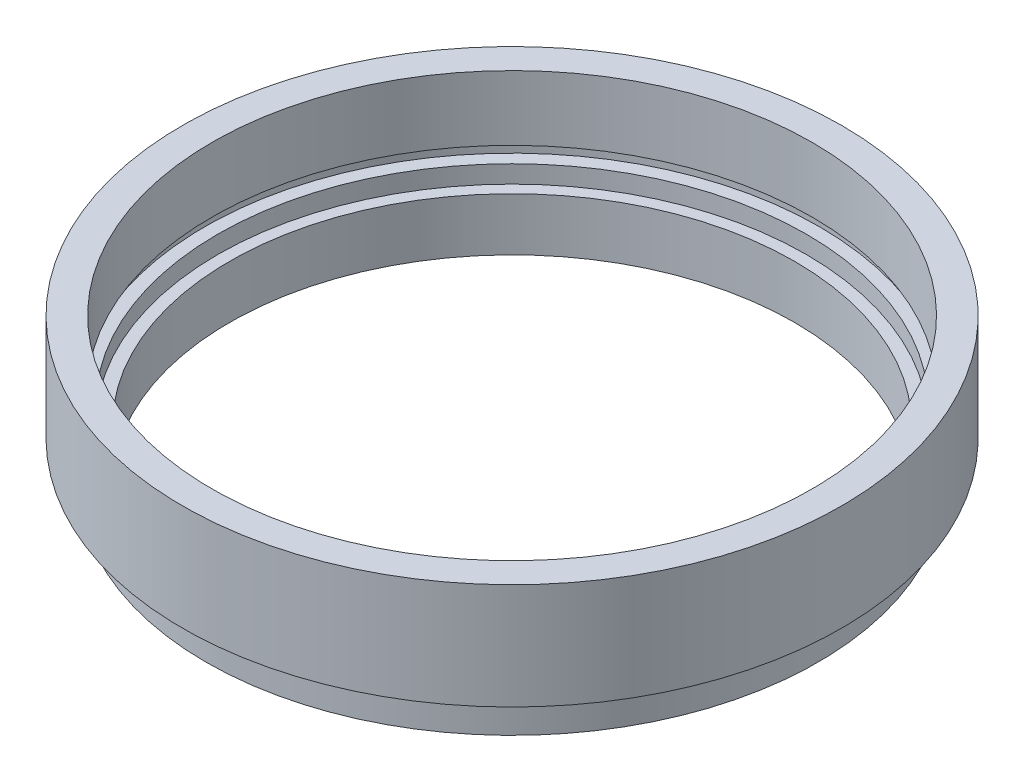
ISO-10303-21;
HEADER;
FILE_DESCRIPTION(('STEP AP214'),'2;1');
FILE_NAME('part.step','',(''),(''),'','','');
FILE_SCHEMA(('AUTOMOTIVE_DESIGN { 1 0 10303 214 1 1 1 1 }'));
ENDSEC;
DATA;
#1=APPLICATION_CONTEXT('core data for automotive mechanical design processes');
#2=APPLICATION_PROTOCOL_DEFINITION('international standard','automotive_design',2000,#1);
#3=PRODUCT_CONTEXT('',#1,'mechanical');
#4=PRODUCT('Part','Part','',(#3));
#5=PRODUCT_RELATED_PRODUCT_CATEGORY('part','',(#4));
#6=PRODUCT_DEFINITION_FORMATION('','',#4);
#7=PRODUCT_DEFINITION_CONTEXT('part definition',#1,'design');
#8=PRODUCT_DEFINITION('design','',#6,#7);
#9=PRODUCT_DEFINITION_SHAPE('','',#8);
#10=(LENGTH_UNIT() NAMED_UNIT(*) SI_UNIT(.MILLI.,.METRE.));
#11=(NAMED_UNIT(*) PLANE_ANGLE_UNIT() SI_UNIT($,.RADIAN.));
#12=(NAMED_UNIT(*) SI_UNIT($,.STERADIAN.) SOLID_ANGLE_UNIT());
#13=UNCERTAINTY_MEASURE_WITH_UNIT(LENGTH_MEASURE(1.E-05),#10,'distance_accuracy_value','');
#14=(GEOMETRIC_REPRESENTATION_CONTEXT(3) GLOBAL_UNCERTAINTY_ASSIGNED_CONTEXT((#13)) GLOBAL_UNIT_ASSIGNED_CONTEXT((#10,
#11,#12)) REPRESENTATION_CONTEXT('',''));
#15=CARTESIAN_POINT('',(0.,0.,0.));
#16=DIRECTION('',(0.,0.,1.));
#17=DIRECTION('',(1.,0.,0.));
#18=AXIS2_PLACEMENT_3D('',#15,#16,#17);
#19=CARTESIAN_POINT('',(0.,0.,0.));
#20=DIRECTION('',(0.,-1.,0.));
#21=DIRECTION('',(0.,0.,-1.));
#22=AXIS2_PLACEMENT_3D('',#19,#20,#21);
#23=CYLINDRICAL_SURFACE('',#22,24.);
#24=CARTESIAN_POINT('',(0.,0.,0.));
#25=DIRECTION('',(0.,-1.,0.));
#26=DIRECTION('',(0.,0.,-1.));
#27=AXIS2_PLACEMENT_3D('',#24,#25,#26);
#28=CIRCLE('',#27,24.);
#29=CARTESIAN_POINT('',(0.,0.,-24.));
#30=VERTEX_POINT('',#29);
#31=EDGE_CURVE('E10',#30,#30,#28,.T.);
#32=ORIENTED_EDGE('',*,*,#31,.T.);
#33=EDGE_LOOP('',(#32));
#34=FACE_BOUND('',#33,.T.);
#35=CARTESIAN_POINT('',(0.,4.5,0.));
#36=DIRECTION('',(0.,-1.,0.));
#37=DIRECTION('',(0.,0.,-1.));
#38=AXIS2_PLACEMENT_3D('',#35,#36,#37);
#39=CIRCLE('',#38,24.);
#40=CARTESIAN_POINT('',(0.,4.5,-24.));
#41=VERTEX_POINT('',#40);
#42=EDGE_CURVE('E79',#41,#41,#39,.T.);
#43=ORIENTED_EDGE('',*,*,#42,.F.);
#44=EDGE_LOOP('',(#43));
#45=FACE_BOUND('',#44,.T.);
#46=ADVANCED_FACE('F33',(#34,#45),#23,.F.);
#47=CARTESIAN_POINT('',(24.,0.,0.));
#48=DIRECTION('',(0.,-1.,0.));
#49=DIRECTION('',(0.,0.,-1.));
#50=AXIS2_PLACEMENT_3D('',#47,#48,#49);
#51=PLANE('',#50);
#52=CARTESIAN_POINT('',(0.,0.,0.));
#53=DIRECTION('',(0.,-1.,0.));
#54=DIRECTION('',(0.,0.,-1.));
#55=AXIS2_PLACEMENT_3D('',#52,#53,#54);
#56=CIRCLE('',#55,26.);
#57=CARTESIAN_POINT('',(0.,0.,-26.));
#58=VERTEX_POINT('',#57);
#59=EDGE_CURVE('E39',#58,#58,#56,.T.);
#60=ORIENTED_EDGE('',*,*,#59,.T.);
#61=EDGE_LOOP('',(#60));
#62=FACE_BOUND('',#61,.T.);
#63=ORIENTED_EDGE('',*,*,#31,.F.);
#64=EDGE_LOOP('',(#63));
#65=FACE_BOUND('',#64,.T.);
#66=ADVANCED_FACE('F87',(#62,#65),#51,.T.);
#67=CARTESIAN_POINT('',(0.,0.,0.));
#68=DIRECTION('',(0.,-1.,0.));
#69=DIRECTION('',(0.,0.,-1.));
#70=AXIS2_PLACEMENT_3D('',#67,#68,#69);
#71=CYLINDRICAL_SURFACE('',#70,26.);
#72=CARTESIAN_POINT('',(0.,2.5,0.));
#73=DIRECTION('',(0.,-1.,0.));
#74=DIRECTION('',(0.,0.,-1.));
#75=AXIS2_PLACEMENT_3D('',#72,#73,#74);
#76=CIRCLE('',#75,26.);
#77=CARTESIAN_POINT('',(0.,2.5,-26.));
#78=VERTEX_POINT('',#77);
#79=EDGE_CURVE('E43',#78,#78,#76,.T.);
#80=ORIENTED_EDGE('',*,*,#79,.T.);
#81=EDGE_LOOP('',(#80));
#82=FACE_BOUND('',#81,.T.);
#83=ORIENTED_EDGE('',*,*,#59,.F.);
#84=EDGE_LOOP('',(#83));
#85=FACE_BOUND('',#84,.T.);
#86=ADVANCED_FACE('F91',(#82,#85),#71,.T.);
#87=CARTESIAN_POINT('',(26.,2.5,0.));
#88=DIRECTION('',(0.,1.,0.));
#89=DIRECTION('',(0.,0.,1.));
#90=AXIS2_PLACEMENT_3D('',#87,#88,#89);
#91=PLANE('',#90);
#92=CARTESIAN_POINT('',(0.,2.5,0.));
#93=DIRECTION('',(0.,-1.,0.));
#94=DIRECTION('',(0.,0.,-1.));
#95=AXIS2_PLACEMENT_3D('',#92,#93,#94);
#96=CIRCLE('',#95,25.5);
#97=CARTESIAN_POINT('',(0.,2.5,-25.5));
#98=VERTEX_POINT('',#97);
#99=EDGE_CURVE('E47',#98,#98,#96,.T.);
#100=ORIENTED_EDGE('',*,*,#99,.T.);
#101=EDGE_LOOP('',(#100));
#102=FACE_BOUND('',#101,.T.);
#103=ORIENTED_EDGE('',*,*,#79,.F.);
#104=EDGE_LOOP('',(#103));
#105=FACE_BOUND('',#104,.T.);
#106=ADVANCED_FACE('F95',(#102,#105),#91,.T.);
#107=CARTESIAN_POINT('',(0.,0.,0.));
#108=DIRECTION('',(0.,-1.,0.));
#109=DIRECTION('',(0.,0.,-1.));
#110=AXIS2_PLACEMENT_3D('',#107,#108,#109);
#111=CYLINDRICAL_SURFACE('',#110,25.5);
#112=CARTESIAN_POINT('',(0.,3.5,0.));
#113=DIRECTION('',(0.,-1.,0.));
#114=DIRECTION('',(0.,0.,-1.));
#115=AXIS2_PLACEMENT_3D('',#112,#113,#114);
#116=CIRCLE('',#115,25.5);
#117=CARTESIAN_POINT('',(0.,3.5,-25.5));
#118=VERTEX_POINT('',#117);
#119=EDGE_CURVE('E52',#118,#118,#116,.T.);
#120=ORIENTED_EDGE('',*,*,#119,.T.);
#121=EDGE_LOOP('',(#120));
#122=FACE_BOUND('',#121,.T.);
#123=ORIENTED_EDGE('',*,*,#99,.F.);
#124=EDGE_LOOP('',(#123));
#125=FACE_BOUND('',#124,.T.);
#126=ADVANCED_FACE('F102',(#122,#125),#111,.T.);
#127=CARTESIAN_POINT('',(25.5,3.5,0.));
#128=DIRECTION('',(0.,-1.,0.));
#129=DIRECTION('',(0.,0.,-1.));
#130=AXIS2_PLACEMENT_3D('',#127,#128,#129);
#131=PLANE('',#130);
#132=CARTESIAN_POINT('',(0.,3.5,0.));
#133=DIRECTION('',(0.,-1.,0.));
#134=DIRECTION('',(0.,0.,-1.));
#135=AXIS2_PLACEMENT_3D('',#132,#133,#134);
#136=CIRCLE('',#135,28.);
#137=CARTESIAN_POINT('',(0.,3.5,-28.));
#138=VERTEX_POINT('',#137);
#139=EDGE_CURVE('E55',#138,#138,#136,.T.);
#140=ORIENTED_EDGE('',*,*,#139,.T.);
#141=EDGE_LOOP('',(#140));
#142=FACE_BOUND('',#141,.T.);
#143=ORIENTED_EDGE('',*,*,#119,.F.);
#144=EDGE_LOOP('',(#143));
#145=FACE_BOUND('',#144,.T.);
#146=ADVANCED_FACE('F106',(#142,#145),#131,.T.);
#147=CARTESIAN_POINT('',(0.,0.,0.));
#148=DIRECTION('',(0.,-1.,0.));
#149=DIRECTION('',(0.,0.,-1.));
#150=AXIS2_PLACEMENT_3D('',#147,#148,#149);
#151=CYLINDRICAL_SURFACE('',#150,28.);
#152=CARTESIAN_POINT('',(0.,12.5,0.));
#153=DIRECTION('',(0.,-1.,0.));
#154=DIRECTION('',(0.,0.,-1.));
#155=AXIS2_PLACEMENT_3D('',#152,#153,#154);
#156=CIRCLE('',#155,28.);
#157=CARTESIAN_POINT('',(0.,12.5,-28.));
#158=VERTEX_POINT('',#157);
#159=EDGE_CURVE('E58',#158,#158,#156,.T.);
#160=ORIENTED_EDGE('',*,*,#159,.T.);
#161=EDGE_LOOP('',(#160));
#162=FACE_BOUND('',#161,.T.);
#163=ORIENTED_EDGE('',*,*,#139,.F.);
#164=EDGE_LOOP('',(#163));
#165=FACE_BOUND('',#164,.T.);
#166=ADVANCED_FACE('F110',(#162,#165),#151,.T.);
#167=CARTESIAN_POINT('',(28.,12.5,0.));
#168=DIRECTION('',(0.,1.,0.));
#169=DIRECTION('',(0.,0.,1.));
#170=AXIS2_PLACEMENT_3D('',#167,#168,#169);
#171=PLANE('',#170);
#172=CARTESIAN_POINT('',(0.,12.5,0.));
#173=DIRECTION('',(0.,-1.,0.));
#174=DIRECTION('',(0.,0.,-1.));
#175=AXIS2_PLACEMENT_3D('',#172,#173,#174);
#176=CIRCLE('',#175,25.5);
#177=CARTESIAN_POINT('',(0.,12.5,-25.5));
#178=VERTEX_POINT('',#177);
#179=EDGE_CURVE('E61',#178,#178,#176,.T.);
#180=ORIENTED_EDGE('',*,*,#179,.T.);
#181=EDGE_LOOP('',(#180));
#182=FACE_BOUND('',#181,.T.);
#183=ORIENTED_EDGE('',*,*,#159,.F.);
#184=EDGE_LOOP('',(#183));
#185=FACE_BOUND('',#184,.T.);
#186=ADVANCED_FACE('F114',(#182,#185),#171,.T.);
#187=CARTESIAN_POINT('',(0.,0.,0.));
#188=DIRECTION('',(0.,-1.,0.));
#189=DIRECTION('',(0.,0.,-1.));
#190=AXIS2_PLACEMENT_3D('',#187,#188,#189);
#191=CYLINDRICAL_SURFACE('',#190,25.5);
#192=CARTESIAN_POINT('',(0.,7.,0.));
#193=DIRECTION('',(0.,-1.,0.));
#194=DIRECTION('',(0.,0.,-1.));
#195=AXIS2_PLACEMENT_3D('',#192,#193,#194);
#196=CIRCLE('',#195,25.5);
#197=CARTESIAN_POINT('',(0.,7.,-25.5));
#198=VERTEX_POINT('',#197);
#199=EDGE_CURVE('E64',#198,#198,#196,.T.);
#200=ORIENTED_EDGE('',*,*,#199,.T.);
#201=EDGE_LOOP('',(#200));
#202=FACE_BOUND('',#201,.T.);
#203=ORIENTED_EDGE('',*,*,#179,.F.);
#204=EDGE_LOOP('',(#203));
#205=FACE_BOUND('',#204,.T.);
#206=ADVANCED_FACE('F118',(#202,#205),#191,.F.);
#207=CARTESIAN_POINT('',(25.5,7.,0.));
#208=DIRECTION('',(0.,-1.,0.));
#209=DIRECTION('',(0.,0.,-1.));
#210=AXIS2_PLACEMENT_3D('',#207,#208,#209);
#211=PLANE('',#210);
#212=CARTESIAN_POINT('',(0.,7.,0.));
#213=DIRECTION('',(0.,-1.,0.));
#214=DIRECTION('',(0.,0.,-1.));
#215=AXIS2_PLACEMENT_3D('',#212,#213,#214);
#216=CIRCLE('',#215,26.1);
#217=CARTESIAN_POINT('',(0.,7.,-26.1));
#218=VERTEX_POINT('',#217);
#219=EDGE_CURVE('E67',#218,#218,#216,.T.);
#220=ORIENTED_EDGE('',*,*,#219,.T.);
#221=EDGE_LOOP('',(#220));
#222=FACE_BOUND('',#221,.T.);
#223=ORIENTED_EDGE('',*,*,#199,.F.);
#224=EDGE_LOOP('',(#223));
#225=FACE_BOUND('',#224,.T.);
#226=ADVANCED_FACE('F122',(#222,#225),#211,.T.);
#227=CARTESIAN_POINT('',(0.,0.,0.));
#228=DIRECTION('',(0.,-1.,0.));
#229=DIRECTION('',(0.,0.,-1.));
#230=AXIS2_PLACEMENT_3D('',#227,#228,#229);
#231=CYLINDRICAL_SURFACE('',#230,26.1);
#232=CARTESIAN_POINT('',(0.,6.,0.));
#233=DIRECTION('',(0.,-1.,0.));
#234=DIRECTION('',(0.,0.,-1.));
#235=AXIS2_PLACEMENT_3D('',#232,#233,#234);
#236=CIRCLE('',#235,26.1);
#237=CARTESIAN_POINT('',(0.,6.,-26.1));
#238=VERTEX_POINT('',#237);
#239=EDGE_CURVE('E70',#238,#238,#236,.T.);
#240=ORIENTED_EDGE('',*,*,#239,.T.);
#241=EDGE_LOOP('',(#240));
#242=FACE_BOUND('',#241,.T.);
#243=ORIENTED_EDGE('',*,*,#219,.F.);
#244=EDGE_LOOP('',(#243));
#245=FACE_BOUND('',#244,.T.);
#246=ADVANCED_FACE('F126',(#242,#245),#231,.F.);
#247=CARTESIAN_POINT('',(26.1,6.,0.));
#248=DIRECTION('',(0.,1.,0.));
#249=DIRECTION('',(0.,0.,1.));
#250=AXIS2_PLACEMENT_3D('',#247,#248,#249);
#251=PLANE('',#250);
#252=CARTESIAN_POINT('',(0.,6.,0.));
#253=DIRECTION('',(0.,-1.,0.));
#254=DIRECTION('',(0.,0.,-1.));
#255=AXIS2_PLACEMENT_3D('',#252,#253,#254);
#256=CIRCLE('',#255,25.);
#257=CARTESIAN_POINT('',(0.,6.,-25.));
#258=VERTEX_POINT('',#257);
#259=EDGE_CURVE('E73',#258,#258,#256,.T.);
#260=ORIENTED_EDGE('',*,*,#259,.T.);
#261=EDGE_LOOP('',(#260));
#262=FACE_BOUND('',#261,.T.);
#263=ORIENTED_EDGE('',*,*,#239,.F.);
#264=EDGE_LOOP('',(#263));
#265=FACE_BOUND('',#264,.T.);
#266=ADVANCED_FACE('F130',(#262,#265),#251,.T.);
#267=CARTESIAN_POINT('',(0.,0.,0.));
#268=DIRECTION('',(0.,-1.,0.));
#269=DIRECTION('',(0.,0.,-1.));
#270=AXIS2_PLACEMENT_3D('',#267,#268,#269);
#271=CYLINDRICAL_SURFACE('',#270,25.);
#272=CARTESIAN_POINT('',(0.,4.5,0.));
#273=DIRECTION('',(0.,-1.,0.));
#274=DIRECTION('',(0.,0.,-1.));
#275=AXIS2_PLACEMENT_3D('',#272,#273,#274);
#276=CIRCLE('',#275,25.);
#277=CARTESIAN_POINT('',(0.,4.5,-25.));
#278=VERTEX_POINT('',#277);
#279=EDGE_CURVE('E76',#278,#278,#276,.T.);
#280=ORIENTED_EDGE('',*,*,#279,.T.);
#281=EDGE_LOOP('',(#280));
#282=FACE_BOUND('',#281,.T.);
#283=ORIENTED_EDGE('',*,*,#259,.F.);
#284=EDGE_LOOP('',(#283));
#285=FACE_BOUND('',#284,.T.);
#286=ADVANCED_FACE('F134',(#282,#285),#271,.F.);
#287=CARTESIAN_POINT('',(25.,4.5,0.));
#288=DIRECTION('',(0.,1.,0.));
#289=DIRECTION('',(0.,0.,1.));
#290=AXIS2_PLACEMENT_3D('',#287,#288,#289);
#291=PLANE('',#290);
#292=ORIENTED_EDGE('',*,*,#42,.T.);
#293=EDGE_LOOP('',(#292));
#294=FACE_BOUND('',#293,.T.);
#295=ORIENTED_EDGE('',*,*,#279,.F.);
#296=EDGE_LOOP('',(#295));
#297=FACE_BOUND('',#296,.T.);
#298=ADVANCED_FACE('F83',(#294,#297),#291,.T.);
#299=CLOSED_SHELL('',(#46,#66,#86,#106,#126,#146,#166,#186,#206,#226,#246,#266,#286,#298));
#300=MANIFOLD_SOLID_BREP('B2',#299);
#301=ADVANCED_BREP_SHAPE_REPRESENTATION('',(#18,#300),#14);
#302=SHAPE_DEFINITION_REPRESENTATION(#9,#301);
ENDSEC;
END-ISO-10303-21;
